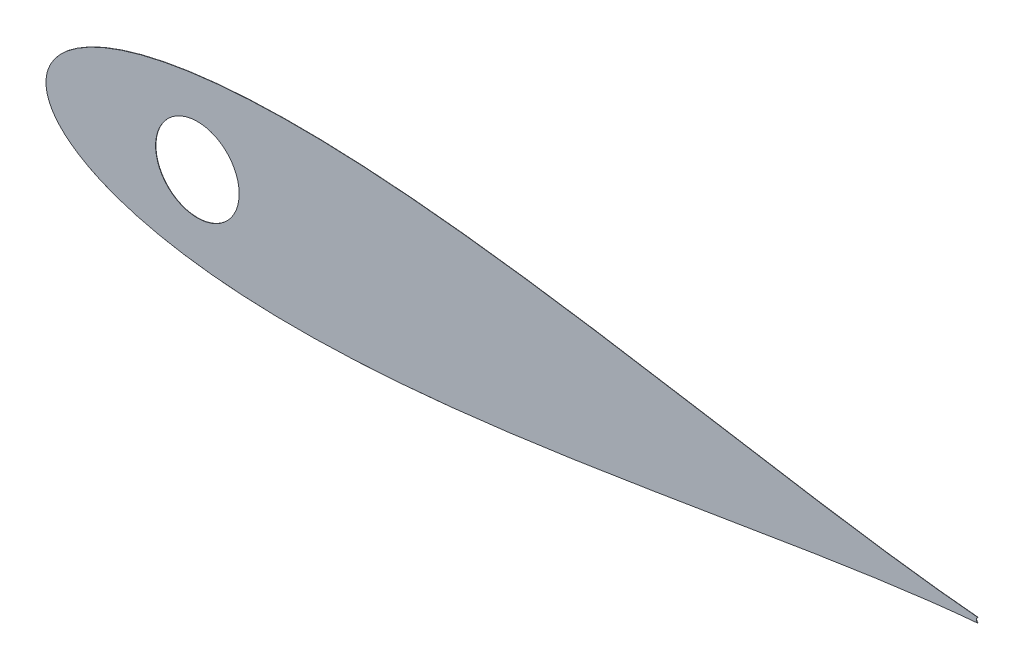
ISO-10303-21;
HEADER;
FILE_DESCRIPTION(('STEP AP214'),'2;1');
FILE_NAME('part.step','',(''),(''),'','','');
FILE_SCHEMA(('AUTOMOTIVE_DESIGN { 1 0 10303 214 1 1 1 1 }'));
ENDSEC;
DATA;
#1=APPLICATION_CONTEXT('core data for automotive mechanical design processes');
#2=APPLICATION_PROTOCOL_DEFINITION('international standard','automotive_design',2000,#1);
#3=PRODUCT_CONTEXT('',#1,'mechanical');
#4=PRODUCT('Part','Part','',(#3));
#5=PRODUCT_RELATED_PRODUCT_CATEGORY('part','',(#4));
#6=PRODUCT_DEFINITION_FORMATION('','',#4);
#7=PRODUCT_DEFINITION_CONTEXT('part definition',#1,'design');
#8=PRODUCT_DEFINITION('design','',#6,#7);
#9=PRODUCT_DEFINITION_SHAPE('','',#8);
#10=(LENGTH_UNIT() NAMED_UNIT(*) SI_UNIT(.MILLI.,.METRE.));
#11=(NAMED_UNIT(*) PLANE_ANGLE_UNIT() SI_UNIT($,.RADIAN.));
#12=(NAMED_UNIT(*) SI_UNIT($,.STERADIAN.) SOLID_ANGLE_UNIT());
#13=UNCERTAINTY_MEASURE_WITH_UNIT(LENGTH_MEASURE(1.E-05),#10,'distance_accuracy_value','');
#14=(GEOMETRIC_REPRESENTATION_CONTEXT(3) GLOBAL_UNCERTAINTY_ASSIGNED_CONTEXT((#13)) GLOBAL_UNIT_ASSIGNED_CONTEXT((#10,
#11,#12)) REPRESENTATION_CONTEXT('',''));
#15=CARTESIAN_POINT('',(0.,0.,0.));
#16=DIRECTION('',(0.,0.,1.));
#17=DIRECTION('',(1.,0.,0.));
#18=AXIS2_PLACEMENT_3D('',#15,#16,#17);
#19=CARTESIAN_POINT('',(733.789817406,570.11300019336,0.127));
#20=DIRECTION('',(0.,0.,-1.));
#21=DIRECTION('',(-1.,0.,0.));
#22=AXIS2_PLACEMENT_3D('',#19,#20,#21);
#23=CYLINDRICAL_SURFACE('',#22,1.2446);
#24=CARTESIAN_POINT('',(733.789817406,570.11300019336,0.));
#25=DIRECTION('',(0.,0.,1.));
#26=DIRECTION('',(1.,0.,0.));
#27=AXIS2_PLACEMENT_3D('',#24,#25,#26);
#28=CIRCLE('',#27,1.2446);
#29=CARTESIAN_POINT('',(733.094458588768,571.145233343039,0.));
#30=VERTEX_POINT('',#29);
#31=CARTESIAN_POINT('',(733.092625489338,569.082004271282,0.));
#32=VERTEX_POINT('',#31);
#33=EDGE_CURVE('E66',#30,#32,#28,.T.);
#34=ORIENTED_EDGE('',*,*,#33,.F.);
#35=DIRECTION('',(0.,0.,-1.));
#36=VECTOR('',#35,1.);
#37=CARTESIAN_POINT('',(733.094458588768,571.145233343039,0.127));
#38=LINE('',#37,#36);
#39=CARTESIAN_POINT('',(733.094458588768,571.145233343039,0.127));
#40=VERTEX_POINT('',#39);
#41=EDGE_CURVE('E11',#40,#30,#38,.T.);
#42=ORIENTED_EDGE('',*,*,#41,.F.);
#43=CARTESIAN_POINT('',(733.789817406,570.11300019336,0.127));
#44=DIRECTION('',(0.,0.,1.));
#45=DIRECTION('',(1.,0.,0.));
#46=AXIS2_PLACEMENT_3D('',#43,#44,#45);
#47=CIRCLE('',#46,1.2446);
#48=CARTESIAN_POINT('',(733.092625489338,569.082004271282,0.127));
#49=VERTEX_POINT('',#48);
#50=EDGE_CURVE('E67',#40,#49,#47,.T.);
#51=ORIENTED_EDGE('',*,*,#50,.T.);
#52=DIRECTION('',(0.,0.,-1.));
#53=VECTOR('',#52,1.);
#54=CARTESIAN_POINT('',(733.092625489338,569.082004271282,0.127));
#55=LINE('',#54,#53);
#56=EDGE_CURVE('E46',#49,#32,#55,.T.);
#57=ORIENTED_EDGE('',*,*,#56,.T.);
#58=EDGE_LOOP('',(#34,#42,#51,#57));
#59=FACE_BOUND('',#58,.T.);
#60=ADVANCED_FACE('F37',(#59),#23,.F.);
#61=CARTESIAN_POINT('',(410.49164457768,570.1136970576,0.127));
#62=DIRECTION('',(0.,0.,-1.));
#63=DIRECTION('',(-1.,0.,0.));
#64=AXIS2_PLACEMENT_3D('',#61,#62,#63);
#65=CYLINDRICAL_SURFACE('',#64,17.2719999999999);
#66=CARTESIAN_POINT('',(410.49164457768,570.1136970576,0.127));
#67=DIRECTION('',(0.,0.,1.));
#68=DIRECTION('',(1.,0.,0.));
#69=AXIS2_PLACEMENT_3D('',#66,#67,#68);
#70=CIRCLE('',#69,17.2719999999999);
#71=CARTESIAN_POINT('',(427.76364457768,570.1136970576,0.127));
#72=VERTEX_POINT('',#71);
#73=EDGE_CURVE('E71',#72,#72,#70,.T.);
#74=ORIENTED_EDGE('',*,*,#73,.T.);
#75=EDGE_LOOP('',(#74));
#76=FACE_BOUND('',#75,.T.);
#77=CARTESIAN_POINT('',(410.49164457768,570.1136970576,0.));
#78=DIRECTION('',(0.,0.,1.));
#79=DIRECTION('',(1.,0.,0.));
#80=AXIS2_PLACEMENT_3D('',#77,#78,#79);
#81=CIRCLE('',#80,17.2719999999999);
#82=CARTESIAN_POINT('',(427.76364457768,570.1136970576,0.));
#83=VERTEX_POINT('',#82);
#84=EDGE_CURVE('E74',#83,#83,#81,.T.);
#85=ORIENTED_EDGE('',*,*,#84,.F.);
#86=EDGE_LOOP('',(#85));
#87=FACE_BOUND('',#86,.T.);
#88=ADVANCED_FACE('F39',(#76,#87),#65,.F.);
#89=CARTESIAN_POINT('',(733.094458588768,571.145233343039,0.127));
#90=CARTESIAN_POINT('',(731.071708037049,571.317921944314,0.127));
#91=CARTESIAN_POINT('',(726.773768323366,571.715269774256,0.127));
#92=CARTESIAN_POINT('',(719.930993216166,572.427098505841,0.127));
#93=CARTESIAN_POINT('',(712.334872672052,573.301658872768,0.127));
#94=CARTESIAN_POINT('',(704.022402008358,574.343315632893,0.127));
#95=CARTESIAN_POINT('',(695.03236248741,575.553129378098,0.127));
#96=CARTESIAN_POINT('',(685.403631287546,576.928387748297,0.127));
#97=CARTESIAN_POINT('',(675.177904293527,578.461986944049,0.127));
#98=CARTESIAN_POINT('',(664.398604914338,580.14301722626,0.127));
#99=CARTESIAN_POINT('',(653.110892107541,581.956469163155,0.127));
#100=CARTESIAN_POINT('',(641.361413459476,583.88361228687,0.127));
#101=CARTESIAN_POINT('',(629.198169584589,585.902229125875,0.127));
#102=CARTESIAN_POINT('',(616.670358597413,587.98684052033,0.127));
#103=CARTESIAN_POINT('',(603.828293671225,590.109161850231,0.127));
#104=CARTESIAN_POINT('',(590.723320287841,592.238442601318,0.127));
#105=CARTESIAN_POINT('',(577.407772952312,594.34197043445,0.127));
#106=CARTESIAN_POINT('',(563.934946828121,596.38551207564,0.127));
#107=CARTESIAN_POINT('',(550.359095610288,598.33392097524,0.127));
#108=CARTESIAN_POINT('',(536.735425172434,600.151583234708,0.127));
#109=CARTESIAN_POINT('',(523.12010696621,601.803052388765,0.127));
#110=CARTESIAN_POINT('',(509.570287350768,603.253558861714,0.127));
#111=CARTESIAN_POINT('',(496.14409632476,604.469623954838,0.127));
#112=CARTESIAN_POINT('',(482.90064197533,605.419548215075,0.127));
#113=CARTESIAN_POINT('',(469.900009328353,606.074004195569,0.127));
#114=CARTESIAN_POINT('',(457.203247278353,606.40658824514,0.127));
#115=CARTESIAN_POINT('',(444.872347821079,606.394240809532,0.127));
#116=CARTESIAN_POINT('',(432.970266906723,606.017374444153,0.127));
#117=CARTESIAN_POINT('',(421.560925424426,605.261233674134,0.127));
#118=CARTESIAN_POINT('',(410.709394945856,604.114853717004,0.127));
#119=CARTESIAN_POINT('',(400.482000776441,602.573067108424,0.127));
#120=CARTESIAN_POINT('',(390.946941922109,600.635333007527,0.127));
#121=CARTESIAN_POINT('',(382.174754120657,598.308135436143,0.127));
#122=CARTESIAN_POINT('',(374.239597628459,595.605113532247,0.127));
#123=CARTESIAN_POINT('',(367.22063336468,592.550351674942,0.127));
#124=CARTESIAN_POINT('',(361.203098108679,589.18430171236,0.127));
#125=CARTESIAN_POINT('',(356.276891113984,585.575270729404,0.127));
#126=CARTESIAN_POINT('',(352.52496408606,581.841134840506,0.127));
#127=CARTESIAN_POINT('',(349.98484951831,578.179330060543,0.127));
#128=CARTESIAN_POINT('',(348.56841084588,574.875654103994,0.127));
#129=CARTESIAN_POINT('',(347.996426136638,572.225488819385,0.127));
#130=CARTESIAN_POINT('',(347.86615146595,570.113697053726,0.127));
#131=CARTESIAN_POINT('',(347.996426136638,568.001905288067,0.127));
#132=CARTESIAN_POINT('',(348.56841084588,565.351740003458,0.127));
#133=CARTESIAN_POINT('',(349.98484951831,562.048064046909,0.127));
#134=CARTESIAN_POINT('',(352.52496408606,558.386259266946,0.127));
#135=CARTESIAN_POINT('',(356.276891113984,554.652123378048,0.127));
#136=CARTESIAN_POINT('',(361.203098108679,551.043092395092,0.127));
#137=CARTESIAN_POINT('',(367.22063336468,547.67704243251,0.127));
#138=CARTESIAN_POINT('',(374.239597628459,544.622280575205,0.127));
#139=CARTESIAN_POINT('',(382.174754120657,541.919258671309,0.127));
#140=CARTESIAN_POINT('',(390.946941922109,539.592061099926,0.127));
#141=CARTESIAN_POINT('',(400.482000776441,537.654326999027,0.127));
#142=CARTESIAN_POINT('',(410.709394945856,536.112540390448,0.127));
#143=CARTESIAN_POINT('',(421.560925424426,534.966160433318,0.127));
#144=CARTESIAN_POINT('',(432.970266906723,534.210019663299,0.127));
#145=CARTESIAN_POINT('',(444.872347821079,533.833153297919,0.127));
#146=CARTESIAN_POINT('',(457.203247278353,533.820805862312,0.127));
#147=CARTESIAN_POINT('',(469.900009328353,534.153389911883,0.127));
#148=CARTESIAN_POINT('',(482.90064197533,534.807845892377,0.127));
#149=CARTESIAN_POINT('',(496.14409632476,535.757770152614,0.127));
#150=CARTESIAN_POINT('',(509.570287350768,536.973835245739,0.127));
#151=CARTESIAN_POINT('',(523.12010696621,538.424341718687,0.127));
#152=CARTESIAN_POINT('',(536.735425172434,540.075810872744,0.127));
#153=CARTESIAN_POINT('',(550.359095610288,541.893473132212,0.127));
#154=CARTESIAN_POINT('',(563.934946828121,543.841882031812,0.127));
#155=CARTESIAN_POINT('',(577.407772952312,545.885423673002,0.127));
#156=CARTESIAN_POINT('',(590.723320287841,547.988951506134,0.127));
#157=CARTESIAN_POINT('',(603.828293671224,550.118232257221,0.127));
#158=CARTESIAN_POINT('',(616.670358597413,552.240553587122,0.127));
#159=CARTESIAN_POINT('',(629.198169584589,554.325164981577,0.127));
#160=CARTESIAN_POINT('',(641.361413459476,556.343781820582,0.127));
#161=CARTESIAN_POINT('',(653.110892107541,558.270924944297,0.127));
#162=CARTESIAN_POINT('',(664.398604914338,560.084376881192,0.127));
#163=CARTESIAN_POINT('',(675.177904293527,561.765407163403,0.127));
#164=CARTESIAN_POINT('',(685.403631287546,563.299006359155,0.127));
#165=CARTESIAN_POINT('',(695.03236248741,564.674264729354,0.127));
#166=CARTESIAN_POINT('',(704.022402008358,565.884078474558,0.127));
#167=CARTESIAN_POINT('',(712.334872672052,566.925735234684,0.127));
#168=CARTESIAN_POINT('',(719.930993216166,567.800295601611,0.127));
#169=CARTESIAN_POINT('',(726.773159482937,568.512060997765,0.127));
#170=CARTESIAN_POINT('',(731.07049164284,568.909359705561,0.127));
#171=CARTESIAN_POINT('',(733.092625489338,569.082004271282,0.127));
#172=B_SPLINE_CURVE_WITH_KNOTS('',3,(#89,#90,#91,#92,#93,#94,#95,#96,#97,#98,#99,#100,#101,#102,
#103,#104,#105,#106,#107,#108,#109,#110,#111,#112,#113,#114,#115,#116,#117,#118,#119,#120,#121,
#122,#123,#124,#125,#126,#127,#128,#129,#130,#131,#132,#133,#134,#135,#136,#137,#138,#139,#140,
#141,#142,#143,#144,#145,#146,#147,#148,#149,#150,#151,#152,#153,#154,#155,#156,#157,#158,#159,
#160,#161,#162,#163,#164,#165,#166,#167,#168,#169,#170,#171),.UNSPECIFIED.,.F.,.F.,(4,1,1,1,1,1,
1,1,1,1,1,1,1,1,1,1,1,1,1,1,1,1,1,1,1,1,1,1,1,1,1,1,1,1,1,1,1,1,1,1,1,1,1,1,1,1,1,1,1,1,1,1,1,1,
1,1,1,1,1,1,1,1,1,1,1,1,1,1,1,1,1,1,1,1,1,1,1,1,1,1,4),(0.0213012549811989,0.0285525550130683,
0.0367806836725549,0.0459201019032637,0.0559317636633187,0.0667728836144854,0.0783971303496518,
0.0907548266908363,0.103793164577546,0.117456431914319,0.131686225652521,0.146421738497113,
0.161599998000845,0.177156132626574,0.193023668070302,0.209134785631037,0.225420632511523,
0.241811601924249,0.258237646860869,0.274628556698349,0.290914287398014,0.307025228908797,
0.322892517177238,0.33844834182358,0.353626206573582,0.368361231970712,0.382590427827798,
0.396252960572084,0.40929041186716,0.421647009590257,0.433269881487031,0.444109248914041,
0.454118639688981,0.463255054987312,0.471479113777303,0.478755288570903,0.485052318112802,
0.490344025694165,0.494609832614287,0.497833231437255,0.5,0.502166768562745,0.505390167385713,
0.509655974305835,0.514947681887198,0.521244711429097,0.528520886222697,0.536744945012688,
0.545881360311019,0.555890751085959,0.566730118512969,0.578352990409744,0.59070958813284,
0.603747039427916,0.617409572172202,0.631638768029288,0.646373793426418,0.66155165817642,
0.677107482822761,0.692974771091203,0.709085712601986,0.725371443301651,0.741762353139131,
0.758188398075751,0.774579367488477,0.790865214368963,0.806976331929698,0.822843867373426,
0.838400001999155,0.853578261502887,0.868313774347479,0.882543568085681,0.896206835422454,
0.909245173309164,0.921602869650348,0.933227116385514,0.944068236336681,0.954079898096736,
0.963219316327445,0.971447444986932,0.978696554540658),.UNSPECIFIED.);
#173=DIRECTION('',(0.,0.,-1.));
#174=VECTOR('',#173,1.);
#175=SURFACE_OF_LINEAR_EXTRUSION('',#172,#174);
#176=CARTESIAN_POINT('',(733.094458588768,571.145233343039,0.));
#177=CARTESIAN_POINT('',(731.071708037049,571.317921944314,0.));
#178=CARTESIAN_POINT('',(726.773768323366,571.715269774256,0.));
#179=CARTESIAN_POINT('',(719.930993216166,572.427098505841,0.));
#180=CARTESIAN_POINT('',(712.334872672052,573.301658872768,0.));
#181=CARTESIAN_POINT('',(704.022402008358,574.343315632893,0.));
#182=CARTESIAN_POINT('',(695.03236248741,575.553129378098,0.));
#183=CARTESIAN_POINT('',(685.403631287546,576.928387748297,0.));
#184=CARTESIAN_POINT('',(675.177904293527,578.461986944049,0.));
#185=CARTESIAN_POINT('',(664.398604914338,580.14301722626,0.));
#186=CARTESIAN_POINT('',(653.110892107541,581.956469163155,0.));
#187=CARTESIAN_POINT('',(641.361413459476,583.88361228687,0.));
#188=CARTESIAN_POINT('',(629.198169584589,585.902229125875,0.));
#189=CARTESIAN_POINT('',(616.670358597413,587.98684052033,0.));
#190=CARTESIAN_POINT('',(603.828293671225,590.109161850231,0.));
#191=CARTESIAN_POINT('',(590.723320287841,592.238442601318,0.));
#192=CARTESIAN_POINT('',(577.407772952312,594.34197043445,0.));
#193=CARTESIAN_POINT('',(563.934946828121,596.38551207564,0.));
#194=CARTESIAN_POINT('',(550.359095610288,598.33392097524,0.));
#195=CARTESIAN_POINT('',(536.735425172434,600.151583234708,0.));
#196=CARTESIAN_POINT('',(523.12010696621,601.803052388765,0.));
#197=CARTESIAN_POINT('',(509.570287350768,603.253558861714,0.));
#198=CARTESIAN_POINT('',(496.14409632476,604.469623954838,0.));
#199=CARTESIAN_POINT('',(482.90064197533,605.419548215075,0.));
#200=CARTESIAN_POINT('',(469.900009328353,606.074004195569,0.));
#201=CARTESIAN_POINT('',(457.203247278353,606.40658824514,0.));
#202=CARTESIAN_POINT('',(444.872347821079,606.394240809532,0.));
#203=CARTESIAN_POINT('',(432.970266906723,606.017374444153,0.));
#204=CARTESIAN_POINT('',(421.560925424426,605.261233674134,0.));
#205=CARTESIAN_POINT('',(410.709394945856,604.114853717004,0.));
#206=CARTESIAN_POINT('',(400.482000776441,602.573067108424,0.));
#207=CARTESIAN_POINT('',(390.946941922109,600.635333007527,0.));
#208=CARTESIAN_POINT('',(382.174754120657,598.308135436143,0.));
#209=CARTESIAN_POINT('',(374.239597628459,595.605113532247,0.));
#210=CARTESIAN_POINT('',(367.22063336468,592.550351674942,0.));
#211=CARTESIAN_POINT('',(361.203098108679,589.18430171236,0.));
#212=CARTESIAN_POINT('',(356.276891113984,585.575270729404,0.));
#213=CARTESIAN_POINT('',(352.52496408606,581.841134840506,0.));
#214=CARTESIAN_POINT('',(349.98484951831,578.179330060543,0.));
#215=CARTESIAN_POINT('',(348.56841084588,574.875654103994,0.));
#216=CARTESIAN_POINT('',(347.996426136638,572.225488819385,0.));
#217=CARTESIAN_POINT('',(347.86615146595,570.113697053726,0.));
#218=CARTESIAN_POINT('',(347.996426136638,568.001905288067,0.));
#219=CARTESIAN_POINT('',(348.56841084588,565.351740003458,0.));
#220=CARTESIAN_POINT('',(349.98484951831,562.048064046909,0.));
#221=CARTESIAN_POINT('',(352.52496408606,558.386259266946,0.));
#222=CARTESIAN_POINT('',(356.276891113984,554.652123378048,0.));
#223=CARTESIAN_POINT('',(361.203098108679,551.043092395092,0.));
#224=CARTESIAN_POINT('',(367.22063336468,547.67704243251,0.));
#225=CARTESIAN_POINT('',(374.239597628459,544.622280575205,0.));
#226=CARTESIAN_POINT('',(382.174754120657,541.919258671309,0.));
#227=CARTESIAN_POINT('',(390.946941922109,539.592061099926,0.));
#228=CARTESIAN_POINT('',(400.482000776441,537.654326999027,0.));
#229=CARTESIAN_POINT('',(410.709394945856,536.112540390448,0.));
#230=CARTESIAN_POINT('',(421.560925424426,534.966160433318,0.));
#231=CARTESIAN_POINT('',(432.970266906723,534.210019663299,0.));
#232=CARTESIAN_POINT('',(444.872347821079,533.833153297919,0.));
#233=CARTESIAN_POINT('',(457.203247278353,533.820805862312,0.));
#234=CARTESIAN_POINT('',(469.900009328353,534.153389911883,0.));
#235=CARTESIAN_POINT('',(482.90064197533,534.807845892377,0.));
#236=CARTESIAN_POINT('',(496.14409632476,535.757770152614,0.));
#237=CARTESIAN_POINT('',(509.570287350768,536.973835245739,0.));
#238=CARTESIAN_POINT('',(523.12010696621,538.424341718687,0.));
#239=CARTESIAN_POINT('',(536.735425172434,540.075810872744,0.));
#240=CARTESIAN_POINT('',(550.359095610288,541.893473132212,0.));
#241=CARTESIAN_POINT('',(563.934946828121,543.841882031812,0.));
#242=CARTESIAN_POINT('',(577.407772952312,545.885423673002,0.));
#243=CARTESIAN_POINT('',(590.723320287841,547.988951506134,0.));
#244=CARTESIAN_POINT('',(603.828293671224,550.118232257221,0.));
#245=CARTESIAN_POINT('',(616.670358597413,552.240553587122,0.));
#246=CARTESIAN_POINT('',(629.198169584589,554.325164981577,0.));
#247=CARTESIAN_POINT('',(641.361413459476,556.343781820582,0.));
#248=CARTESIAN_POINT('',(653.110892107541,558.270924944297,0.));
#249=CARTESIAN_POINT('',(664.398604914338,560.084376881192,0.));
#250=CARTESIAN_POINT('',(675.177904293527,561.765407163403,0.));
#251=CARTESIAN_POINT('',(685.403631287546,563.299006359155,0.));
#252=CARTESIAN_POINT('',(695.03236248741,564.674264729354,0.));
#253=CARTESIAN_POINT('',(704.022402008358,565.884078474558,0.));
#254=CARTESIAN_POINT('',(712.334872672052,566.925735234684,0.));
#255=CARTESIAN_POINT('',(719.930993216166,567.800295601611,0.));
#256=CARTESIAN_POINT('',(726.773159482937,568.512060997765,0.));
#257=CARTESIAN_POINT('',(731.07049164284,568.909359705561,0.));
#258=CARTESIAN_POINT('',(733.092625489338,569.082004271282,0.));
#259=B_SPLINE_CURVE_WITH_KNOTS('',3,(#176,#177,#178,#179,#180,#181,#182,#183,#184,#185,#186,
#187,#188,#189,#190,#191,#192,#193,#194,#195,#196,#197,#198,#199,#200,#201,#202,#203,#204,#205,
#206,#207,#208,#209,#210,#211,#212,#213,#214,#215,#216,#217,#218,#219,#220,#221,#222,#223,#224,
#225,#226,#227,#228,#229,#230,#231,#232,#233,#234,#235,#236,#237,#238,#239,#240,#241,#242,#243,
#244,#245,#246,#247,#248,#249,#250,#251,#252,#253,#254,#255,#256,#257,#258),.UNSPECIFIED.,.F.,
.F.,(4,1,1,1,1,1,1,1,1,1,1,1,1,1,1,1,1,1,1,1,1,1,1,1,1,1,1,1,1,1,1,1,1,1,1,1,1,1,1,1,1,1,1,1,1,
1,1,1,1,1,1,1,1,1,1,1,1,1,1,1,1,1,1,1,1,1,1,1,1,1,1,1,1,1,1,1,1,1,1,1,4),(0.0213012549811989,
0.0285525550130683,0.0367806836725549,0.0459201019032637,0.0559317636633187,0.0667728836144854,
0.0783971303496518,0.0907548266908363,0.103793164577546,0.117456431914319,0.131686225652521,
0.146421738497113,0.161599998000845,0.177156132626574,0.193023668070302,0.209134785631037,
0.225420632511523,0.241811601924249,0.258237646860869,0.274628556698349,0.290914287398014,
0.307025228908797,0.322892517177238,0.33844834182358,0.353626206573582,0.368361231970712,
0.382590427827798,0.396252960572084,0.40929041186716,0.421647009590257,0.433269881487031,
0.444109248914041,0.454118639688981,0.463255054987312,0.471479113777303,0.478755288570903,
0.485052318112802,0.490344025694165,0.494609832614287,0.497833231437255,0.5,0.502166768562745,
0.505390167385713,0.509655974305835,0.514947681887198,0.521244711429097,0.528520886222697,
0.536744945012688,0.545881360311019,0.555890751085959,0.566730118512969,0.578352990409744,
0.59070958813284,0.603747039427916,0.617409572172202,0.631638768029288,0.646373793426418,
0.66155165817642,0.677107482822761,0.692974771091203,0.709085712601986,0.725371443301651,
0.741762353139131,0.758188398075751,0.774579367488477,0.790865214368963,0.806976331929698,
0.822843867373426,0.838400001999155,0.853578261502887,0.868313774347479,0.882543568085681,
0.896206835422454,0.909245173309164,0.921602869650348,0.933227116385514,0.944068236336681,
0.954079898096736,0.963219316327445,0.971447444986932,0.978696554540658),.UNSPECIFIED.);
#260=EDGE_CURVE('E68',#30,#32,#259,.T.);
#261=ORIENTED_EDGE('',*,*,#260,.T.);
#262=ORIENTED_EDGE('',*,*,#56,.F.);
#263=EDGE_CURVE('E53',#40,#49,#172,.T.);
#264=ORIENTED_EDGE('',*,*,#263,.F.);
#265=ORIENTED_EDGE('',*,*,#41,.T.);
#266=EDGE_LOOP('',(#261,#262,#264,#265));
#267=FACE_BOUND('',#266,.T.);
#268=ADVANCED_FACE('F69',(#267),#175,.F.);
#269=CARTESIAN_POINT('',(0.,0.,0.127));
#270=DIRECTION('',(0.,0.,1.));
#271=DIRECTION('',(1.,0.,0.));
#272=AXIS2_PLACEMENT_3D('',#269,#270,#271);
#273=PLANE('',#272);
#274=ORIENTED_EDGE('',*,*,#73,.F.);
#275=EDGE_LOOP('',(#274));
#276=FACE_BOUND('',#275,.T.);
#277=ORIENTED_EDGE('',*,*,#50,.F.);
#278=ORIENTED_EDGE('',*,*,#263,.T.);
#279=EDGE_LOOP('',(#277,#278));
#280=FACE_BOUND('',#279,.T.);
#281=ADVANCED_FACE('F95',(#276,#280),#273,.T.);
#282=CARTESIAN_POINT('',(0.,0.,0.));
#283=DIRECTION('',(0.,0.,1.));
#284=DIRECTION('',(1.,0.,0.));
#285=AXIS2_PLACEMENT_3D('',#282,#283,#284);
#286=PLANE('',#285);
#287=ORIENTED_EDGE('',*,*,#84,.T.);
#288=EDGE_LOOP('',(#287));
#289=FACE_BOUND('',#288,.T.);
#290=ORIENTED_EDGE('',*,*,#33,.T.);
#291=ORIENTED_EDGE('',*,*,#260,.F.);
#292=EDGE_LOOP('',(#290,#291));
#293=FACE_BOUND('',#292,.T.);
#294=ADVANCED_FACE('F73',(#289,#293),#286,.F.);
#295=CLOSED_SHELL('',(#60,#88,#268,#281,#294));
#296=MANIFOLD_SOLID_BREP('B2',#295);
#297=ADVANCED_BREP_SHAPE_REPRESENTATION('',(#18,#296),#14);
#298=SHAPE_DEFINITION_REPRESENTATION(#9,#297);
ENDSEC;
END-ISO-10303-21;
